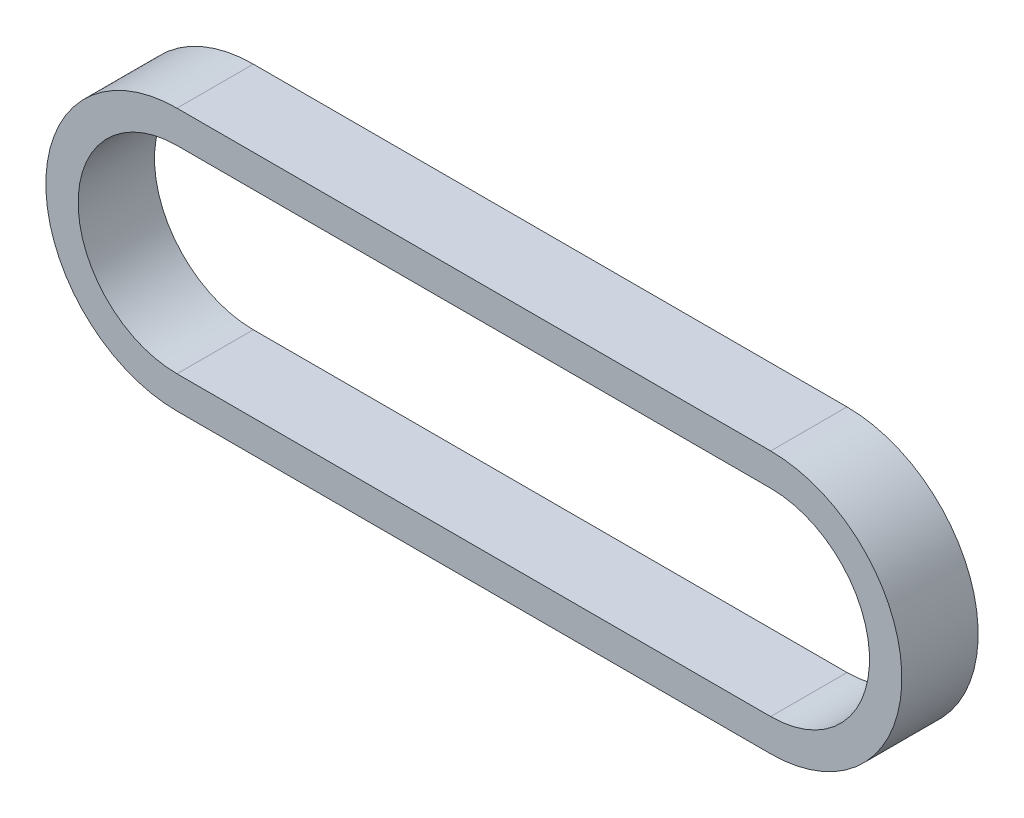
ISO-10303-21;
HEADER;
FILE_DESCRIPTION(('STEP AP214'),'2;1');
FILE_NAME('part.step','',(''),(''),'','','');
FILE_SCHEMA(('AUTOMOTIVE_DESIGN { 1 0 10303 214 1 1 1 1 }'));
ENDSEC;
DATA;
#1=APPLICATION_CONTEXT('core data for automotive mechanical design processes');
#2=APPLICATION_PROTOCOL_DEFINITION('international standard','automotive_design',2000,#1);
#3=PRODUCT_CONTEXT('',#1,'mechanical');
#4=PRODUCT('Part','Part','',(#3));
#5=PRODUCT_RELATED_PRODUCT_CATEGORY('part','',(#4));
#6=PRODUCT_DEFINITION_FORMATION('','',#4);
#7=PRODUCT_DEFINITION_CONTEXT('part definition',#1,'design');
#8=PRODUCT_DEFINITION('design','',#6,#7);
#9=PRODUCT_DEFINITION_SHAPE('','',#8);
#10=(LENGTH_UNIT() NAMED_UNIT(*) SI_UNIT(.MILLI.,.METRE.));
#11=(NAMED_UNIT(*) PLANE_ANGLE_UNIT() SI_UNIT($,.RADIAN.));
#12=(NAMED_UNIT(*) SI_UNIT($,.STERADIAN.) SOLID_ANGLE_UNIT());
#13=UNCERTAINTY_MEASURE_WITH_UNIT(LENGTH_MEASURE(1.E-05),#10,'distance_accuracy_value','');
#14=(GEOMETRIC_REPRESENTATION_CONTEXT(3) GLOBAL_UNCERTAINTY_ASSIGNED_CONTEXT((#13)) GLOBAL_UNIT_ASSIGNED_CONTEXT((#10,
#11,#12)) REPRESENTATION_CONTEXT('',''));
#15=CARTESIAN_POINT('',(0.,0.,0.));
#16=DIRECTION('',(0.,0.,1.));
#17=DIRECTION('',(1.,0.,0.));
#18=AXIS2_PLACEMENT_3D('',#15,#16,#17);
#19=CARTESIAN_POINT('',(0.,0.,4.5));
#20=DIRECTION('',(0.,0.,1.));
#21=DIRECTION('',(1.,0.,0.));
#22=AXIS2_PLACEMENT_3D('',#19,#20,#21);
#23=PLANE('',#22);
#24=CARTESIAN_POINT('',(0.,0.,4.5));
#25=DIRECTION('',(0.,0.,1.));
#26=DIRECTION('',(1.,0.,0.));
#27=AXIS2_PLACEMENT_3D('',#24,#25,#26);
#28=CIRCLE('',#27,15.4669567079091);
#29=CARTESIAN_POINT('',(0.,15.4669567079091,4.5));
#30=VERTEX_POINT('',#29);
#31=CARTESIAN_POINT('',(0.,-15.4669567079091,4.5));
#32=VERTEX_POINT('',#31);
#33=EDGE_CURVE('E158',#30,#32,#28,.T.);
#34=ORIENTED_EDGE('',*,*,#33,.T.);
#35=DIRECTION('',(1.,0.,0.));
#36=VECTOR('',#35,1.);
#37=CARTESIAN_POINT('',(0.,-15.4669567079091,4.5));
#38=LINE('',#37,#36);
#39=CARTESIAN_POINT('',(69.999999954,-15.4669567079091,4.5));
#40=VERTEX_POINT('',#39);
#41=EDGE_CURVE('E161',#32,#40,#38,.T.);
#42=ORIENTED_EDGE('',*,*,#41,.T.);
#43=CARTESIAN_POINT('',(69.999999954,0.,4.5));
#44=DIRECTION('',(0.,0.,1.));
#45=DIRECTION('',(1.,0.,0.));
#46=AXIS2_PLACEMENT_3D('',#43,#44,#45);
#47=CIRCLE('',#46,15.4669567079091);
#48=CARTESIAN_POINT('',(69.999999954,15.4669567079091,4.5));
#49=VERTEX_POINT('',#48);
#50=EDGE_CURVE('E164',#40,#49,#47,.T.);
#51=ORIENTED_EDGE('',*,*,#50,.T.);
#52=DIRECTION('',(-1.,0.,0.));
#53=VECTOR('',#52,1.);
#54=CARTESIAN_POINT('',(0.,15.4669567079091,4.5));
#55=LINE('',#54,#53);
#56=EDGE_CURVE('E166',#49,#30,#55,.T.);
#57=ORIENTED_EDGE('',*,*,#56,.T.);
#58=EDGE_LOOP('',(#34,#42,#51,#57));
#59=FACE_BOUND('',#58,.T.);
#60=DIRECTION('',(1.,0.,0.));
#61=VECTOR('',#60,1.);
#62=CARTESIAN_POINT('',(0.,-11.6569567079091,4.5));
#63=LINE('',#62,#61);
#64=CARTESIAN_POINT('',(0.,-11.6569567079091,4.5));
#65=VERTEX_POINT('',#64);
#66=CARTESIAN_POINT('',(69.999999954,-11.656956707909,4.5));
#67=VERTEX_POINT('',#66);
#68=EDGE_CURVE('E130',#65,#67,#63,.T.);
#69=ORIENTED_EDGE('',*,*,#68,.F.);
#70=CARTESIAN_POINT('',(0.,0.,4.5));
#71=DIRECTION('',(0.,0.,1.));
#72=DIRECTION('',(1.,0.,0.));
#73=AXIS2_PLACEMENT_3D('',#70,#71,#72);
#74=CIRCLE('',#73,11.6569567079091);
#75=CARTESIAN_POINT('',(0.,11.6569567079091,4.5));
#76=VERTEX_POINT('',#75);
#77=EDGE_CURVE('E122',#76,#65,#74,.T.);
#78=ORIENTED_EDGE('',*,*,#77,.F.);
#79=DIRECTION('',(-1.,0.,0.));
#80=VECTOR('',#79,1.);
#81=CARTESIAN_POINT('',(0.,11.6569567079091,4.5));
#82=LINE('',#81,#80);
#83=CARTESIAN_POINT('',(69.999999954,11.656956707909,4.5));
#84=VERTEX_POINT('',#83);
#85=EDGE_CURVE('E144',#84,#76,#82,.T.);
#86=ORIENTED_EDGE('',*,*,#85,.F.);
#87=CARTESIAN_POINT('',(69.999999954,0.,4.5));
#88=DIRECTION('',(0.,0.,1.));
#89=DIRECTION('',(1.,0.,0.));
#90=AXIS2_PLACEMENT_3D('',#87,#88,#89);
#91=CIRCLE('',#90,11.656956707909);
#92=EDGE_CURVE('E142',#67,#84,#91,.T.);
#93=ORIENTED_EDGE('',*,*,#92,.F.);
#94=EDGE_LOOP('',(#69,#78,#86,#93));
#95=FACE_BOUND('',#94,.T.);
#96=ADVANCED_FACE('F57',(#59,#95),#23,.T.);
#97=CARTESIAN_POINT('',(0.,0.,-4.5));
#98=DIRECTION('',(0.,0.,1.));
#99=DIRECTION('',(1.,0.,0.));
#100=AXIS2_PLACEMENT_3D('',#97,#98,#99);
#101=PLANE('',#100);
#102=CARTESIAN_POINT('',(0.,0.,-4.5));
#103=DIRECTION('',(0.,0.,1.));
#104=DIRECTION('',(1.,0.,0.));
#105=AXIS2_PLACEMENT_3D('',#102,#103,#104);
#106=CIRCLE('',#105,15.4669567079091);
#107=CARTESIAN_POINT('',(0.,15.4669567079091,-4.5));
#108=VERTEX_POINT('',#107);
#109=CARTESIAN_POINT('',(0.,-15.4669567079091,-4.5));
#110=VERTEX_POINT('',#109);
#111=EDGE_CURVE('E138',#108,#110,#106,.T.);
#112=ORIENTED_EDGE('',*,*,#111,.F.);
#113=DIRECTION('',(-1.,0.,0.));
#114=VECTOR('',#113,1.);
#115=CARTESIAN_POINT('',(0.,15.4669567079091,-4.5));
#116=LINE('',#115,#114);
#117=CARTESIAN_POINT('',(69.999999954,15.4669567079091,-4.5));
#118=VERTEX_POINT('',#117);
#119=EDGE_CURVE('E162',#118,#108,#116,.T.);
#120=ORIENTED_EDGE('',*,*,#119,.F.);
#121=CARTESIAN_POINT('',(69.999999954,0.,-4.5));
#122=DIRECTION('',(0.,0.,1.));
#123=DIRECTION('',(1.,0.,0.));
#124=AXIS2_PLACEMENT_3D('',#121,#122,#123);
#125=CIRCLE('',#124,15.4669567079091);
#126=CARTESIAN_POINT('',(69.999999954,-15.4669567079091,-4.5));
#127=VERTEX_POINT('',#126);
#128=EDGE_CURVE('E173',#127,#118,#125,.T.);
#129=ORIENTED_EDGE('',*,*,#128,.F.);
#130=DIRECTION('',(1.,0.,0.));
#131=VECTOR('',#130,1.);
#132=CARTESIAN_POINT('',(0.,-15.4669567079091,-4.5));
#133=LINE('',#132,#131);
#134=EDGE_CURVE('E171',#110,#127,#133,.T.);
#135=ORIENTED_EDGE('',*,*,#134,.F.);
#136=EDGE_LOOP('',(#112,#120,#129,#135));
#137=FACE_BOUND('',#136,.T.);
#138=CARTESIAN_POINT('',(0.,0.,-4.5));
#139=DIRECTION('',(0.,0.,1.));
#140=DIRECTION('',(1.,0.,0.));
#141=AXIS2_PLACEMENT_3D('',#138,#139,#140);
#142=CIRCLE('',#141,11.6569567079091);
#143=CARTESIAN_POINT('',(0.,11.6569567079091,-4.5));
#144=VERTEX_POINT('',#143);
#145=CARTESIAN_POINT('',(0.,-11.6569567079091,-4.5));
#146=VERTEX_POINT('',#145);
#147=EDGE_CURVE('E80',#144,#146,#142,.T.);
#148=ORIENTED_EDGE('',*,*,#147,.T.);
#149=DIRECTION('',(1.,0.,0.));
#150=VECTOR('',#149,1.);
#151=CARTESIAN_POINT('',(0.,-11.6569567079091,-4.5));
#152=LINE('',#151,#150);
#153=CARTESIAN_POINT('',(69.999999954,-11.656956707909,-4.5));
#154=VERTEX_POINT('',#153);
#155=EDGE_CURVE('E137',#146,#154,#152,.T.);
#156=ORIENTED_EDGE('',*,*,#155,.T.);
#157=CARTESIAN_POINT('',(69.999999954,0.,-4.5));
#158=DIRECTION('',(0.,0.,1.));
#159=DIRECTION('',(1.,0.,0.));
#160=AXIS2_PLACEMENT_3D('',#157,#158,#159);
#161=CIRCLE('',#160,11.656956707909);
#162=CARTESIAN_POINT('',(69.999999954,11.656956707909,-4.5));
#163=VERTEX_POINT('',#162);
#164=EDGE_CURVE('E150',#154,#163,#161,.T.);
#165=ORIENTED_EDGE('',*,*,#164,.T.);
#166=DIRECTION('',(-1.,0.,0.));
#167=VECTOR('',#166,1.);
#168=CARTESIAN_POINT('',(0.,11.6569567079091,-4.5));
#169=LINE('',#168,#167);
#170=EDGE_CURVE('E131',#163,#144,#169,.T.);
#171=ORIENTED_EDGE('',*,*,#170,.T.);
#172=EDGE_LOOP('',(#148,#156,#165,#171));
#173=FACE_BOUND('',#172,.T.);
#174=ADVANCED_FACE('F191',(#137,#173),#101,.F.);
#175=CARTESIAN_POINT('',(0.,0.,4.5));
#176=DIRECTION('',(0.,0.,-1.));
#177=DIRECTION('',(-1.,0.,0.));
#178=AXIS2_PLACEMENT_3D('',#175,#176,#177);
#179=CYLINDRICAL_SURFACE('',#178,15.4669567079091);
#180=ORIENTED_EDGE('',*,*,#111,.T.);
#181=DIRECTION('',(0.,0.,-1.));
#182=VECTOR('',#181,1.);
#183=CARTESIAN_POINT('',(0.,-15.4669567079091,4.5));
#184=LINE('',#183,#182);
#185=EDGE_CURVE('E12',#32,#110,#184,.T.);
#186=ORIENTED_EDGE('',*,*,#185,.F.);
#187=ORIENTED_EDGE('',*,*,#33,.F.);
#188=DIRECTION('',(0.,0.,-1.));
#189=VECTOR('',#188,1.);
#190=CARTESIAN_POINT('',(0.,15.4669567079091,4.5));
#191=LINE('',#190,#189);
#192=EDGE_CURVE('E168',#30,#108,#191,.T.);
#193=ORIENTED_EDGE('',*,*,#192,.T.);
#194=EDGE_LOOP('',(#180,#186,#187,#193));
#195=FACE_BOUND('',#194,.T.);
#196=ADVANCED_FACE('F59',(#195),#179,.T.);
#197=CARTESIAN_POINT('',(0.,-15.4669567079091,4.5));
#198=DIRECTION('',(0.,1.,0.));
#199=DIRECTION('',(-1.,0.,0.));
#200=AXIS2_PLACEMENT_3D('',#197,#198,#199);
#201=PLANE('',#200);
#202=ORIENTED_EDGE('',*,*,#134,.T.);
#203=DIRECTION('',(0.,0.,-1.));
#204=VECTOR('',#203,1.);
#205=CARTESIAN_POINT('',(69.999999954,-15.4669567079091,4.5));
#206=LINE('',#205,#204);
#207=EDGE_CURVE('E65',#40,#127,#206,.T.);
#208=ORIENTED_EDGE('',*,*,#207,.F.);
#209=ORIENTED_EDGE('',*,*,#41,.F.);
#210=ORIENTED_EDGE('',*,*,#185,.T.);
#211=EDGE_LOOP('',(#202,#208,#209,#210));
#212=FACE_BOUND('',#211,.T.);
#213=ADVANCED_FACE('F201',(#212),#201,.F.);
#214=CARTESIAN_POINT('',(69.999999954,0.,4.5));
#215=DIRECTION('',(0.,0.,-1.));
#216=DIRECTION('',(-1.,0.,0.));
#217=AXIS2_PLACEMENT_3D('',#214,#215,#216);
#218=CYLINDRICAL_SURFACE('',#217,15.4669567079091);
#219=ORIENTED_EDGE('',*,*,#128,.T.);
#220=DIRECTION('',(0.,0.,-1.));
#221=VECTOR('',#220,1.);
#222=CARTESIAN_POINT('',(69.999999954,15.4669567079091,4.5));
#223=LINE('',#222,#221);
#224=EDGE_CURVE('E178',#49,#118,#223,.T.);
#225=ORIENTED_EDGE('',*,*,#224,.F.);
#226=ORIENTED_EDGE('',*,*,#50,.F.);
#227=ORIENTED_EDGE('',*,*,#207,.T.);
#228=EDGE_LOOP('',(#219,#225,#226,#227));
#229=FACE_BOUND('',#228,.T.);
#230=ADVANCED_FACE('F185',(#229),#218,.T.);
#231=CARTESIAN_POINT('',(0.,15.4669567079091,4.5));
#232=DIRECTION('',(0.,-1.,0.));
#233=DIRECTION('',(1.,0.,0.));
#234=AXIS2_PLACEMENT_3D('',#231,#232,#233);
#235=PLANE('',#234);
#236=ORIENTED_EDGE('',*,*,#119,.T.);
#237=ORIENTED_EDGE('',*,*,#192,.F.);
#238=ORIENTED_EDGE('',*,*,#56,.F.);
#239=ORIENTED_EDGE('',*,*,#224,.T.);
#240=EDGE_LOOP('',(#236,#237,#238,#239));
#241=FACE_BOUND('',#240,.T.);
#242=ADVANCED_FACE('F195',(#241),#235,.F.);
#243=CARTESIAN_POINT('',(0.,0.,4.5));
#244=DIRECTION('',(0.,0.,-1.));
#245=DIRECTION('',(-1.,0.,0.));
#246=AXIS2_PLACEMENT_3D('',#243,#244,#245);
#247=CYLINDRICAL_SURFACE('',#246,11.6569567079091);
#248=ORIENTED_EDGE('',*,*,#147,.F.);
#249=DIRECTION('',(0.,0.,-1.));
#250=VECTOR('',#249,1.);
#251=CARTESIAN_POINT('',(0.,11.6569567079091,4.5));
#252=LINE('',#251,#250);
#253=EDGE_CURVE('E126',#76,#144,#252,.T.);
#254=ORIENTED_EDGE('',*,*,#253,.F.);
#255=ORIENTED_EDGE('',*,*,#77,.T.);
#256=DIRECTION('',(0.,0.,-1.));
#257=VECTOR('',#256,1.);
#258=CARTESIAN_POINT('',(0.,-11.6569567079091,4.5));
#259=LINE('',#258,#257);
#260=EDGE_CURVE('E125',#65,#146,#259,.T.);
#261=ORIENTED_EDGE('',*,*,#260,.T.);
#262=EDGE_LOOP('',(#248,#254,#255,#261));
#263=FACE_BOUND('',#262,.T.);
#264=ADVANCED_FACE('F124',(#263),#247,.F.);
#265=CARTESIAN_POINT('',(0.,-11.6569567079091,4.5));
#266=DIRECTION('',(0.,1.,0.));
#267=DIRECTION('',(-1.,0.,0.));
#268=AXIS2_PLACEMENT_3D('',#265,#266,#267);
#269=PLANE('',#268);
#270=ORIENTED_EDGE('',*,*,#155,.F.);
#271=ORIENTED_EDGE('',*,*,#260,.F.);
#272=ORIENTED_EDGE('',*,*,#68,.T.);
#273=DIRECTION('',(0.,0.,-1.));
#274=VECTOR('',#273,1.);
#275=CARTESIAN_POINT('',(69.999999954,-11.656956707909,4.5));
#276=LINE('',#275,#274);
#277=EDGE_CURVE('E139',#67,#154,#276,.T.);
#278=ORIENTED_EDGE('',*,*,#277,.T.);
#279=EDGE_LOOP('',(#270,#271,#272,#278));
#280=FACE_BOUND('',#279,.T.);
#281=ADVANCED_FACE('F134',(#280),#269,.T.);
#282=CARTESIAN_POINT('',(69.999999954,0.,4.5));
#283=DIRECTION('',(0.,0.,-1.));
#284=DIRECTION('',(-1.,0.,0.));
#285=AXIS2_PLACEMENT_3D('',#282,#283,#284);
#286=CYLINDRICAL_SURFACE('',#285,11.656956707909);
#287=ORIENTED_EDGE('',*,*,#164,.F.);
#288=ORIENTED_EDGE('',*,*,#277,.F.);
#289=ORIENTED_EDGE('',*,*,#92,.T.);
#290=DIRECTION('',(0.,0.,-1.));
#291=VECTOR('',#290,1.);
#292=CARTESIAN_POINT('',(69.999999954,11.656956707909,4.5));
#293=LINE('',#292,#291);
#294=EDGE_CURVE('E72',#84,#163,#293,.T.);
#295=ORIENTED_EDGE('',*,*,#294,.T.);
#296=EDGE_LOOP('',(#287,#288,#289,#295));
#297=FACE_BOUND('',#296,.T.);
#298=ADVANCED_FACE('F224',(#297),#286,.F.);
#299=CARTESIAN_POINT('',(0.,11.6569567079091,4.5));
#300=DIRECTION('',(0.,-1.,0.));
#301=DIRECTION('',(1.,0.,0.));
#302=AXIS2_PLACEMENT_3D('',#299,#300,#301);
#303=PLANE('',#302);
#304=ORIENTED_EDGE('',*,*,#170,.F.);
#305=ORIENTED_EDGE('',*,*,#294,.F.);
#306=ORIENTED_EDGE('',*,*,#85,.T.);
#307=ORIENTED_EDGE('',*,*,#253,.T.);
#308=EDGE_LOOP('',(#304,#305,#306,#307));
#309=FACE_BOUND('',#308,.T.);
#310=ADVANCED_FACE('F228',(#309),#303,.T.);
#311=CLOSED_SHELL('',(#96,#174,#196,#213,#230,#242,#264,#281,#298,#310));
#312=MANIFOLD_SOLID_BREP('B2',#311);
#313=ADVANCED_BREP_SHAPE_REPRESENTATION('',(#18,#312),#14);
#314=SHAPE_DEFINITION_REPRESENTATION(#9,#313);
ENDSEC;
END-ISO-10303-21;
